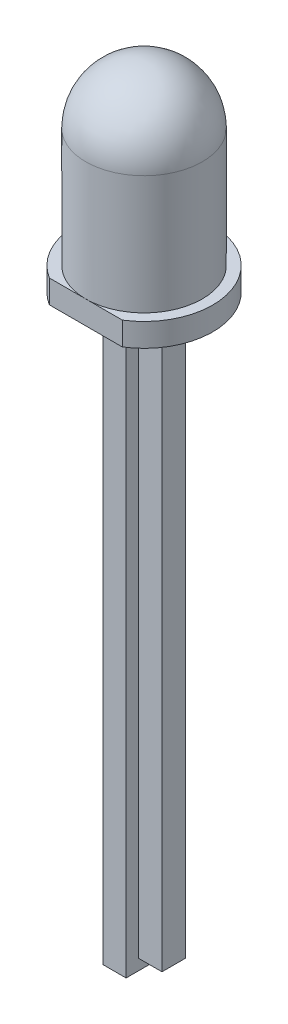
ISO-10303-21;
HEADER;
FILE_DESCRIPTION(('STEP AP214'),'2;1');
FILE_NAME('part.step','',(''),(''),'','','');
FILE_SCHEMA(('AUTOMOTIVE_DESIGN { 1 0 10303 214 1 1 1 1 }'));
ENDSEC;
DATA;
#1=APPLICATION_CONTEXT('core data for automotive mechanical design processes');
#2=APPLICATION_PROTOCOL_DEFINITION('international standard','automotive_design',2000,#1);
#3=PRODUCT_CONTEXT('',#1,'mechanical');
#4=PRODUCT('Part','Part','',(#3));
#5=PRODUCT_RELATED_PRODUCT_CATEGORY('part','',(#4));
#6=PRODUCT_DEFINITION_FORMATION('','',#4);
#7=PRODUCT_DEFINITION_CONTEXT('part definition',#1,'design');
#8=PRODUCT_DEFINITION('design','',#6,#7);
#9=PRODUCT_DEFINITION_SHAPE('','',#8);
#10=(LENGTH_UNIT() NAMED_UNIT(*) SI_UNIT(.MILLI.,.METRE.));
#11=(NAMED_UNIT(*) PLANE_ANGLE_UNIT() SI_UNIT($,.RADIAN.));
#12=(NAMED_UNIT(*) SI_UNIT($,.STERADIAN.) SOLID_ANGLE_UNIT());
#13=UNCERTAINTY_MEASURE_WITH_UNIT(LENGTH_MEASURE(1.E-05),#10,'distance_accuracy_value','');
#14=(GEOMETRIC_REPRESENTATION_CONTEXT(3) GLOBAL_UNCERTAINTY_ASSIGNED_CONTEXT((#13)) GLOBAL_UNIT_ASSIGNED_CONTEXT((#10,
#11,#12)) REPRESENTATION_CONTEXT('',''));
#15=CARTESIAN_POINT('',(0.,0.,0.));
#16=DIRECTION('',(0.,0.,1.));
#17=DIRECTION('',(1.,0.,0.));
#18=AXIS2_PLACEMENT_3D('',#15,#16,#17);
#19=CARTESIAN_POINT('',(-0.499999999999584,0.381000000000242,0.5));
#20=DIRECTION('',(0.,0.,-1.));
#21=DIRECTION('',(-1.,0.,0.));
#22=AXIS2_PLACEMENT_3D('',#19,#20,#21);
#23=PLANE('',#22);
#24=CARTESIAN_POINT('',(0.75400000000006,-0.254000000000434,0.5));
#25=DIRECTION('',(0.,0.,-1.));
#26=DIRECTION('',(-1.,0.,0.));
#27=AXIS2_PLACEMENT_3D('',#24,#25,#26);
#28=CIRCLE('',#27,0.254);
#29=CARTESIAN_POINT('',(0.50000000000007,-0.254000000000185,0.5));
#30=VERTEX_POINT('',#29);
#31=CARTESIAN_POINT('',(0.754000000000005,-4.44089209850063E-13,0.5));
#32=VERTEX_POINT('',#31);
#33=EDGE_CURVE('E179',#30,#32,#28,.T.);
#34=ORIENTED_EDGE('',*,*,#33,.T.);
#35=DIRECTION('',(0.,-1.,0.));
#36=VECTOR('',#35,1.);
#37=CARTESIAN_POINT('',(0.754000000000421,0.380999999999562,0.5));
#38=LINE('',#37,#36);
#39=CARTESIAN_POINT('',(0.754000000000421,0.380999999999562,0.5));
#40=VERTEX_POINT('',#39);
#41=EDGE_CURVE('E167',#40,#32,#38,.T.);
#42=ORIENTED_EDGE('',*,*,#41,.F.);
#43=DIRECTION('',(1.,0.,0.));
#44=VECTOR('',#43,1.);
#45=CARTESIAN_POINT('',(-0.499999999999584,0.381000000000242,0.5));
#46=LINE('',#45,#44);
#47=CARTESIAN_POINT('',(-0.24599999999958,0.381000000000242,0.5));
#48=VERTEX_POINT('',#47);
#49=EDGE_CURVE('E231',#48,#40,#46,.T.);
#50=ORIENTED_EDGE('',*,*,#49,.F.);
#51=CARTESIAN_POINT('',(-0.245999999999566,0.127000000000252,0.5));
#52=DIRECTION('',(0.,0.,-1.));
#53=DIRECTION('',(-1.,0.,0.));
#54=AXIS2_PLACEMENT_3D('',#51,#52,#53);
#55=CIRCLE('',#54,0.254);
#56=CARTESIAN_POINT('',(-0.49999999999957,0.127000000000252,0.5));
#57=VERTEX_POINT('',#56);
#58=EDGE_CURVE('E261',#48,#57,#55,.F.);
#59=ORIENTED_EDGE('',*,*,#58,.T.);
#60=DIRECTION('',(0.,-1.,0.));
#61=VECTOR('',#60,1.);
#62=CARTESIAN_POINT('',(-0.499999999999584,0.381000000000242,0.5));
#63=LINE('',#62,#61);
#64=CARTESIAN_POINT('',(-0.499999999999584,-24.9999999999995,0.5));
#65=VERTEX_POINT('',#64);
#66=EDGE_CURVE('E243',#57,#65,#63,.T.);
#67=ORIENTED_EDGE('',*,*,#66,.T.);
#68=DIRECTION('',(-1.,0.,0.));
#69=VECTOR('',#68,1.);
#70=CARTESIAN_POINT('',(0.500000000000417,-24.9999999999998,0.5));
#71=LINE('',#70,#69);
#72=CARTESIAN_POINT('',(0.500000000000417,-24.9999999999998,0.5));
#73=VERTEX_POINT('',#72);
#74=EDGE_CURVE('E291',#73,#65,#71,.T.);
#75=ORIENTED_EDGE('',*,*,#74,.F.);
#76=DIRECTION('',(0.,1.,0.));
#77=VECTOR('',#76,1.);
#78=CARTESIAN_POINT('',(0.5,-23.9999999999998,0.5));
#79=LINE('',#78,#77);
#80=EDGE_CURVE('E181',#73,#30,#79,.T.);
#81=ORIENTED_EDGE('',*,*,#80,.T.);
#82=EDGE_LOOP('',(#34,#42,#50,#59,#67,#75,#81));
#83=FACE_BOUND('',#82,.T.);
#84=ADVANCED_FACE('F51',(#83),#23,.F.);
#85=CARTESIAN_POINT('',(-0.499999999999584,0.381000000000242,-0.5));
#86=DIRECTION('',(0.,0.,1.));
#87=DIRECTION('',(1.,0.,0.));
#88=AXIS2_PLACEMENT_3D('',#85,#86,#87);
#89=PLANE('',#88);
#90=DIRECTION('',(-1.,0.,0.));
#91=VECTOR('',#90,1.);
#92=CARTESIAN_POINT('',(-0.499999999999584,0.381000000000242,-0.5));
#93=LINE('',#92,#91);
#94=CARTESIAN_POINT('',(0.754000000000421,0.380999999999562,-0.5));
#95=VERTEX_POINT('',#94);
#96=CARTESIAN_POINT('',(-0.24599999999958,0.381000000000242,-0.5));
#97=VERTEX_POINT('',#96);
#98=EDGE_CURVE('E233',#95,#97,#93,.T.);
#99=ORIENTED_EDGE('',*,*,#98,.F.);
#100=DIRECTION('',(0.,-1.,0.));
#101=VECTOR('',#100,1.);
#102=CARTESIAN_POINT('',(0.754000000000421,0.380999999999562,-0.5));
#103=LINE('',#102,#101);
#104=CARTESIAN_POINT('',(0.754000000000005,-4.44089209850063E-13,-0.5));
#105=VERTEX_POINT('',#104);
#106=EDGE_CURVE('E318',#95,#105,#103,.T.);
#107=ORIENTED_EDGE('',*,*,#106,.T.);
#108=CARTESIAN_POINT('',(0.75400000000006,-0.254000000000434,-0.5));
#109=DIRECTION('',(0.,0.,1.));
#110=DIRECTION('',(1.,0.,0.));
#111=AXIS2_PLACEMENT_3D('',#108,#109,#110);
#112=CIRCLE('',#111,0.254);
#113=CARTESIAN_POINT('',(0.50000000000007,-0.254000000000185,-0.5));
#114=VERTEX_POINT('',#113);
#115=EDGE_CURVE('E74',#105,#114,#112,.T.);
#116=ORIENTED_EDGE('',*,*,#115,.T.);
#117=DIRECTION('',(0.,1.,0.));
#118=VECTOR('',#117,1.);
#119=CARTESIAN_POINT('',(0.5,-23.9999999999998,-0.5));
#120=LINE('',#119,#118);
#121=CARTESIAN_POINT('',(0.500000000000417,-24.9999999999998,-0.5));
#122=VERTEX_POINT('',#121);
#123=EDGE_CURVE('E247',#122,#114,#120,.T.);
#124=ORIENTED_EDGE('',*,*,#123,.F.);
#125=DIRECTION('',(1.,0.,0.));
#126=VECTOR('',#125,1.);
#127=CARTESIAN_POINT('',(-0.499999999999584,-24.9999999999995,-0.5));
#128=LINE('',#127,#126);
#129=CARTESIAN_POINT('',(-0.499999999999584,-24.9999999999995,-0.5));
#130=VERTEX_POINT('',#129);
#131=EDGE_CURVE('E281',#130,#122,#128,.T.);
#132=ORIENTED_EDGE('',*,*,#131,.F.);
#133=DIRECTION('',(0.,-1.,0.));
#134=VECTOR('',#133,1.);
#135=CARTESIAN_POINT('',(-0.499999999999584,0.381000000000242,-0.5));
#136=LINE('',#135,#134);
#137=CARTESIAN_POINT('',(-0.49999999999957,0.127000000000252,-0.5));
#138=VERTEX_POINT('',#137);
#139=EDGE_CURVE('E237',#138,#130,#136,.T.);
#140=ORIENTED_EDGE('',*,*,#139,.F.);
#141=CARTESIAN_POINT('',(-0.245999999999566,0.127000000000252,-0.5));
#142=DIRECTION('',(0.,0.,1.));
#143=DIRECTION('',(1.,0.,0.));
#144=AXIS2_PLACEMENT_3D('',#141,#142,#143);
#145=CIRCLE('',#144,0.254);
#146=EDGE_CURVE('E267',#138,#97,#145,.F.);
#147=ORIENTED_EDGE('',*,*,#146,.T.);
#148=EDGE_LOOP('',(#99,#107,#116,#124,#132,#140,#147));
#149=FACE_BOUND('',#148,.T.);
#150=ADVANCED_FACE('F279',(#149),#89,.F.);
#151=CARTESIAN_POINT('',(-0.499999999999584,0.381000000000242,-0.5));
#152=DIRECTION('',(1.,0.,0.));
#153=DIRECTION('',(0.,0.,-1.));
#154=AXIS2_PLACEMENT_3D('',#151,#152,#153);
#155=PLANE('',#154);
#156=ORIENTED_EDGE('',*,*,#66,.F.);
#157=DIRECTION('',(0.,0.,1.));
#158=VECTOR('',#157,1.);
#159=CARTESIAN_POINT('',(-0.49999999999957,0.127000000000252,-0.5));
#160=LINE('',#159,#158);
#161=EDGE_CURVE('E263',#57,#138,#160,.F.);
#162=ORIENTED_EDGE('',*,*,#161,.T.);
#163=ORIENTED_EDGE('',*,*,#139,.T.);
#164=DIRECTION('',(0.,0.,-1.));
#165=VECTOR('',#164,1.);
#166=CARTESIAN_POINT('',(-0.499999999999584,-24.9999999999995,0.5));
#167=LINE('',#166,#165);
#168=EDGE_CURVE('E287',#65,#130,#167,.T.);
#169=ORIENTED_EDGE('',*,*,#168,.F.);
#170=EDGE_LOOP('',(#156,#162,#163,#169));
#171=FACE_BOUND('',#170,.T.);
#172=ADVANCED_FACE('F341',(#171),#155,.F.);
#173=CARTESIAN_POINT('',(0.786000000000411,0.380999999999562,0.5));
#174=VERTEX_POINT('',#173);
#175=CARTESIAN_POINT('',(1.78600000000041,0.380999999999812,0.5));
#176=VERTEX_POINT('',#175);
#177=EDGE_CURVE('E234',#174,#176,#46,.T.);
#178=ORIENTED_EDGE('',*,*,#177,.F.);
#179=DIRECTION('',(0.,1.,0.));
#180=VECTOR('',#179,1.);
#181=CARTESIAN_POINT('',(0.786000000000411,0.380999999999562,0.5));
#182=LINE('',#181,#180);
#183=CARTESIAN_POINT('',(0.786000000000009,-4.44089209850063E-13,0.5));
#184=VERTEX_POINT('',#183);
#185=EDGE_CURVE('E66',#184,#174,#182,.T.);
#186=ORIENTED_EDGE('',*,*,#185,.F.);
#187=CARTESIAN_POINT('',(0.786000000000064,-0.254000000000434,0.5));
#188=DIRECTION('',(0.,0.,-1.));
#189=DIRECTION('',(-1.,0.,0.));
#190=AXIS2_PLACEMENT_3D('',#187,#188,#189);
#191=CIRCLE('',#190,0.254);
#192=CARTESIAN_POINT('',(1.04000000000007,-0.253999999999754,0.5));
#193=VERTEX_POINT('',#192);
#194=EDGE_CURVE('E59',#184,#193,#191,.T.);
#195=ORIENTED_EDGE('',*,*,#194,.T.);
#196=DIRECTION('',(0.,1.,0.));
#197=VECTOR('',#196,1.);
#198=CARTESIAN_POINT('',(1.04,-23.9999999999999,0.5));
#199=LINE('',#198,#197);
#200=CARTESIAN_POINT('',(1.04,-23.9999999999999,0.5));
#201=VERTEX_POINT('',#200);
#202=EDGE_CURVE('E206',#201,#193,#199,.T.);
#203=ORIENTED_EDGE('',*,*,#202,.F.);
#204=DIRECTION('',(-1.,0.,0.));
#205=VECTOR('',#204,1.);
#206=CARTESIAN_POINT('',(2.04,-23.9999999999998,0.5));
#207=LINE('',#206,#205);
#208=CARTESIAN_POINT('',(2.04,-23.9999999999998,0.5));
#209=VERTEX_POINT('',#208);
#210=EDGE_CURVE('E297',#209,#201,#207,.T.);
#211=ORIENTED_EDGE('',*,*,#210,.F.);
#212=DIRECTION('',(0.,-1.,0.));
#213=VECTOR('',#212,1.);
#214=CARTESIAN_POINT('',(2.04000000000042,0.380999999999812,0.5));
#215=LINE('',#214,#213);
#216=CARTESIAN_POINT('',(2.04000000000047,0.126999999999808,0.5));
#217=VERTEX_POINT('',#216);
#218=EDGE_CURVE('E241',#217,#209,#215,.T.);
#219=ORIENTED_EDGE('',*,*,#218,.F.);
#220=CARTESIAN_POINT('',(1.78600000000043,0.126999999999808,0.5));
#221=DIRECTION('',(0.,0.,-1.));
#222=DIRECTION('',(-1.,0.,0.));
#223=AXIS2_PLACEMENT_3D('',#220,#221,#222);
#224=CIRCLE('',#223,0.254);
#225=EDGE_CURVE('E258',#217,#176,#224,.F.);
#226=ORIENTED_EDGE('',*,*,#225,.T.);
#227=EDGE_LOOP('',(#178,#186,#195,#203,#211,#219,#226));
#228=FACE_BOUND('',#227,.T.);
#229=ADVANCED_FACE('F204',(#228),#23,.F.);
#230=CARTESIAN_POINT('',(2.04000000000042,0.380999999999812,-0.5));
#231=DIRECTION('',(-1.,0.,0.));
#232=DIRECTION('',(0.,0.,1.));
#233=AXIS2_PLACEMENT_3D('',#230,#231,#232);
#234=PLANE('',#233);
#235=DIRECTION('',(0.,-1.,0.));
#236=VECTOR('',#235,1.);
#237=CARTESIAN_POINT('',(2.04000000000042,0.380999999999812,-0.5));
#238=LINE('',#237,#236);
#239=CARTESIAN_POINT('',(2.04000000000047,0.126999999999808,-0.5));
#240=VERTEX_POINT('',#239);
#241=CARTESIAN_POINT('',(2.04,-23.9999999999998,-0.5));
#242=VERTEX_POINT('',#241);
#243=EDGE_CURVE('E239',#240,#242,#238,.T.);
#244=ORIENTED_EDGE('',*,*,#243,.F.);
#245=DIRECTION('',(0.,0.,-1.));
#246=VECTOR('',#245,1.);
#247=CARTESIAN_POINT('',(2.04000000000047,0.126999999999808,0.5));
#248=LINE('',#247,#246);
#249=EDGE_CURVE('E270',#240,#217,#248,.F.);
#250=ORIENTED_EDGE('',*,*,#249,.T.);
#251=ORIENTED_EDGE('',*,*,#218,.T.);
#252=DIRECTION('',(0.,0.,1.));
#253=VECTOR('',#252,1.);
#254=CARTESIAN_POINT('',(2.04,-23.9999999999998,0.5));
#255=LINE('',#254,#253);
#256=EDGE_CURVE('E289',#242,#209,#255,.T.);
#257=ORIENTED_EDGE('',*,*,#256,.F.);
#258=EDGE_LOOP('',(#244,#250,#251,#257));
#259=FACE_BOUND('',#258,.T.);
#260=ADVANCED_FACE('F368',(#259),#234,.F.);
#261=CARTESIAN_POINT('',(0.786000000000064,-0.254000000000434,-0.5));
#262=DIRECTION('',(0.,0.,1.));
#263=DIRECTION('',(1.,0.,0.));
#264=AXIS2_PLACEMENT_3D('',#261,#262,#263);
#265=CIRCLE('',#264,0.254);
#266=CARTESIAN_POINT('',(1.04000000000007,-0.253999999999754,-0.5));
#267=VERTEX_POINT('',#266);
#268=CARTESIAN_POINT('',(0.786000000000009,-4.44089209850063E-13,-0.5));
#269=VERTEX_POINT('',#268);
#270=EDGE_CURVE('E197',#267,#269,#265,.T.);
#271=ORIENTED_EDGE('',*,*,#270,.T.);
#272=DIRECTION('',(0.,1.,0.));
#273=VECTOR('',#272,1.);
#274=CARTESIAN_POINT('',(0.786000000000411,0.380999999999562,-0.5));
#275=LINE('',#274,#273);
#276=CARTESIAN_POINT('',(0.786000000000411,0.380999999999562,-0.5));
#277=VERTEX_POINT('',#276);
#278=EDGE_CURVE('E222',#269,#277,#275,.T.);
#279=ORIENTED_EDGE('',*,*,#278,.T.);
#280=CARTESIAN_POINT('',(1.78600000000041,0.380999999999812,-0.5));
#281=VERTEX_POINT('',#280);
#282=EDGE_CURVE('E235',#281,#277,#93,.T.);
#283=ORIENTED_EDGE('',*,*,#282,.F.);
#284=CARTESIAN_POINT('',(1.78600000000043,0.126999999999808,-0.5));
#285=DIRECTION('',(0.,0.,1.));
#286=DIRECTION('',(1.,0.,0.));
#287=AXIS2_PLACEMENT_3D('',#284,#285,#286);
#288=CIRCLE('',#287,0.254);
#289=EDGE_CURVE('E265',#281,#240,#288,.F.);
#290=ORIENTED_EDGE('',*,*,#289,.T.);
#291=ORIENTED_EDGE('',*,*,#243,.T.);
#292=DIRECTION('',(1.,0.,0.));
#293=VECTOR('',#292,1.);
#294=CARTESIAN_POINT('',(2.04,-23.9999999999998,-0.5));
#295=LINE('',#294,#293);
#296=CARTESIAN_POINT('',(1.04,-23.9999999999999,-0.5));
#297=VERTEX_POINT('',#296);
#298=EDGE_CURVE('E226',#297,#242,#295,.T.);
#299=ORIENTED_EDGE('',*,*,#298,.F.);
#300=DIRECTION('',(0.,1.,0.));
#301=VECTOR('',#300,1.);
#302=CARTESIAN_POINT('',(1.04,-23.9999999999999,-0.5));
#303=LINE('',#302,#301);
#304=EDGE_CURVE('E216',#297,#267,#303,.T.);
#305=ORIENTED_EDGE('',*,*,#304,.T.);
#306=EDGE_LOOP('',(#271,#279,#283,#290,#291,#299,#305));
#307=FACE_BOUND('',#306,.T.);
#308=ADVANCED_FACE('F221',(#307),#89,.F.);
#309=CARTESIAN_POINT('',(0.5,-23.9999999999998,0.5));
#310=DIRECTION('',(-1.,0.,0.));
#311=DIRECTION('',(0.,0.,1.));
#312=AXIS2_PLACEMENT_3D('',#309,#310,#311);
#313=PLANE('',#312);
#314=ORIENTED_EDGE('',*,*,#123,.T.);
#315=DIRECTION('',(0.,0.,1.));
#316=VECTOR('',#315,1.);
#317=CARTESIAN_POINT('',(0.50000000000007,-0.254000000000185,0.5));
#318=LINE('',#317,#316);
#319=EDGE_CURVE('E192',#114,#30,#318,.T.);
#320=ORIENTED_EDGE('',*,*,#319,.T.);
#321=ORIENTED_EDGE('',*,*,#80,.F.);
#322=DIRECTION('',(0.,0.,1.));
#323=VECTOR('',#322,1.);
#324=CARTESIAN_POINT('',(0.500000000000417,-24.9999999999998,-0.5));
#325=LINE('',#324,#323);
#326=EDGE_CURVE('E275',#122,#73,#325,.T.);
#327=ORIENTED_EDGE('',*,*,#326,.F.);
#328=EDGE_LOOP('',(#314,#320,#321,#327));
#329=FACE_BOUND('',#328,.T.);
#330=ADVANCED_FACE('F272',(#329),#313,.F.);
#331=CARTESIAN_POINT('',(1.04,-23.9999999999999,0.5));
#332=DIRECTION('',(1.,0.,0.));
#333=DIRECTION('',(0.,0.,-1.));
#334=AXIS2_PLACEMENT_3D('',#331,#332,#333);
#335=PLANE('',#334);
#336=ORIENTED_EDGE('',*,*,#202,.T.);
#337=DIRECTION('',(0.,0.,-1.));
#338=VECTOR('',#337,1.);
#339=CARTESIAN_POINT('',(1.04000000000007,-0.253999999999754,-0.5));
#340=LINE('',#339,#338);
#341=EDGE_CURVE('E185',#193,#267,#340,.T.);
#342=ORIENTED_EDGE('',*,*,#341,.T.);
#343=ORIENTED_EDGE('',*,*,#304,.F.);
#344=DIRECTION('',(0.,0.,-1.));
#345=VECTOR('',#344,1.);
#346=CARTESIAN_POINT('',(1.04,-23.9999999999999,0.5));
#347=LINE('',#346,#345);
#348=EDGE_CURVE('E215',#201,#297,#347,.T.);
#349=ORIENTED_EDGE('',*,*,#348,.F.);
#350=EDGE_LOOP('',(#336,#342,#343,#349));
#351=FACE_BOUND('',#350,.T.);
#352=ADVANCED_FACE('F212',(#351),#335,.F.);
#353=CARTESIAN_POINT('',(2.04,-23.9999999999998,-0.5));
#354=DIRECTION('',(0.,1.,0.));
#355=DIRECTION('',(0.,0.,1.));
#356=AXIS2_PLACEMENT_3D('',#353,#354,#355);
#357=PLANE('',#356);
#358=ORIENTED_EDGE('',*,*,#256,.T.);
#359=ORIENTED_EDGE('',*,*,#210,.T.);
#360=ORIENTED_EDGE('',*,*,#348,.T.);
#361=ORIENTED_EDGE('',*,*,#298,.T.);
#362=EDGE_LOOP('',(#358,#359,#360,#361));
#363=FACE_BOUND('',#362,.T.);
#364=ADVANCED_FACE('F299',(#363),#357,.F.);
#365=CARTESIAN_POINT('',(4.16333634234434E-13,-24.9999999999999,0.));
#366=DIRECTION('',(0.,-1.,0.));
#367=DIRECTION('',(0.,0.,-1.));
#368=AXIS2_PLACEMENT_3D('',#365,#366,#367);
#369=PLANE('',#368);
#370=ORIENTED_EDGE('',*,*,#74,.T.);
#371=ORIENTED_EDGE('',*,*,#168,.T.);
#372=ORIENTED_EDGE('',*,*,#131,.T.);
#373=ORIENTED_EDGE('',*,*,#326,.T.);
#374=EDGE_LOOP('',(#370,#371,#372,#373));
#375=FACE_BOUND('',#374,.T.);
#376=ADVANCED_FACE('F285',(#375),#369,.T.);
#377=CARTESIAN_POINT('',(-0.245999999999566,0.127000000000252,0.5));
#378=DIRECTION('',(0.,0.,-1.));
#379=DIRECTION('',(-1.,0.,0.));
#380=AXIS2_PLACEMENT_3D('',#377,#378,#379);
#381=CYLINDRICAL_SURFACE('',#380,0.254);
#382=ORIENTED_EDGE('',*,*,#146,.F.);
#383=ORIENTED_EDGE('',*,*,#161,.F.);
#384=ORIENTED_EDGE('',*,*,#58,.F.);
#385=DIRECTION('',(0.,0.,1.));
#386=VECTOR('',#385,1.);
#387=CARTESIAN_POINT('',(-0.24599999999958,0.381000000000242,0.5));
#388=LINE('',#387,#386);
#389=EDGE_CURVE('E255',#97,#48,#388,.T.);
#390=ORIENTED_EDGE('',*,*,#389,.F.);
#391=EDGE_LOOP('',(#382,#383,#384,#390));
#392=FACE_BOUND('',#391,.T.);
#393=ADVANCED_FACE('F345',(#392),#381,.T.);
#394=CARTESIAN_POINT('',(1.78600000000043,0.126999999999808,0.5));
#395=DIRECTION('',(0.,0.,1.));
#396=DIRECTION('',(1.,0.,0.));
#397=AXIS2_PLACEMENT_3D('',#394,#395,#396);
#398=CYLINDRICAL_SURFACE('',#397,0.254);
#399=ORIENTED_EDGE('',*,*,#225,.F.);
#400=ORIENTED_EDGE('',*,*,#249,.F.);
#401=ORIENTED_EDGE('',*,*,#289,.F.);
#402=DIRECTION('',(0.,0.,-1.));
#403=VECTOR('',#402,1.);
#404=CARTESIAN_POINT('',(1.78600000000041,0.380999999999812,-0.5));
#405=LINE('',#404,#403);
#406=EDGE_CURVE('E245',#176,#281,#405,.T.);
#407=ORIENTED_EDGE('',*,*,#406,.F.);
#408=EDGE_LOOP('',(#399,#400,#401,#407));
#409=FACE_BOUND('',#408,.T.);
#410=ADVANCED_FACE('F307',(#409),#398,.T.);
#411=CARTESIAN_POINT('',(0.75400000000006,-0.254000000000434,0.5));
#412=DIRECTION('',(0.,0.,-1.));
#413=DIRECTION('',(-1.,0.,0.));
#414=AXIS2_PLACEMENT_3D('',#411,#412,#413);
#415=CYLINDRICAL_SURFACE('',#414,0.254);
#416=ORIENTED_EDGE('',*,*,#115,.F.);
#417=DIRECTION('',(0.,0.,1.));
#418=VECTOR('',#417,1.);
#419=CARTESIAN_POINT('',(0.754000000000005,-4.44089209850063E-13,-0.5));
#420=LINE('',#419,#418);
#421=EDGE_CURVE('E171',#32,#105,#420,.F.);
#422=ORIENTED_EDGE('',*,*,#421,.F.);
#423=ORIENTED_EDGE('',*,*,#33,.F.);
#424=ORIENTED_EDGE('',*,*,#319,.F.);
#425=EDGE_LOOP('',(#416,#422,#423,#424));
#426=FACE_BOUND('',#425,.T.);
#427=ADVANCED_FACE('F187',(#426),#415,.F.);
#428=CARTESIAN_POINT('',(0.786000000000064,-0.254000000000434,0.5));
#429=DIRECTION('',(0.,0.,1.));
#430=DIRECTION('',(1.,0.,0.));
#431=AXIS2_PLACEMENT_3D('',#428,#429,#430);
#432=CYLINDRICAL_SURFACE('',#431,0.254);
#433=ORIENTED_EDGE('',*,*,#194,.F.);
#434=DIRECTION('',(0.,0.,-1.));
#435=VECTOR('',#434,1.);
#436=CARTESIAN_POINT('',(0.786000000000009,-4.44089209850063E-13,0.5));
#437=LINE('',#436,#435);
#438=EDGE_CURVE('E188',#269,#184,#437,.F.);
#439=ORIENTED_EDGE('',*,*,#438,.F.);
#440=ORIENTED_EDGE('',*,*,#270,.F.);
#441=ORIENTED_EDGE('',*,*,#341,.F.);
#442=EDGE_LOOP('',(#433,#439,#440,#441));
#443=FACE_BOUND('',#442,.T.);
#444=ADVANCED_FACE('F218',(#443),#432,.F.);
#445=CARTESIAN_POINT('',(0.770000000000409,0.380999999999562,0.));
#446=DIRECTION('',(0.,1.,0.));
#447=DIRECTION('',(0.,0.,1.));
#448=AXIS2_PLACEMENT_3D('',#445,#446,#447);
#449=PLANE('',#448);
#450=DIRECTION('',(0.,0.,1.));
#451=VECTOR('',#450,1.);
#452=CARTESIAN_POINT('',(0.754000000000421,0.380999999999562,-2.95000000000001));
#453=LINE('',#452,#451);
#454=EDGE_CURVE('E173',#95,#40,#453,.T.);
#455=ORIENTED_EDGE('',*,*,#454,.F.);
#456=ORIENTED_EDGE('',*,*,#98,.T.);
#457=ORIENTED_EDGE('',*,*,#389,.T.);
#458=ORIENTED_EDGE('',*,*,#49,.T.);
#459=EDGE_LOOP('',(#455,#456,#457,#458));
#460=FACE_BOUND('',#459,.T.);
#461=ORIENTED_EDGE('',*,*,#282,.T.);
#462=DIRECTION('',(0.,0.,1.));
#463=VECTOR('',#462,1.);
#464=CARTESIAN_POINT('',(0.786000000000411,0.380999999999562,-2.95000000000001));
#465=LINE('',#464,#463);
#466=EDGE_CURVE('E312',#277,#174,#465,.T.);
#467=ORIENTED_EDGE('',*,*,#466,.T.);
#468=ORIENTED_EDGE('',*,*,#177,.T.);
#469=ORIENTED_EDGE('',*,*,#406,.T.);
#470=EDGE_LOOP('',(#461,#467,#468,#469));
#471=FACE_BOUND('',#470,.T.);
#472=DIRECTION('',(1.,0.,0.));
#473=VECTOR('',#472,1.);
#474=CARTESIAN_POINT('',(2.33604597633698,0.380999999999812,2.5));
#475=LINE('',#474,#473);
#476=CARTESIAN_POINT('',(-0.796045976336188,0.381000000000464,2.5));
#477=VERTEX_POINT('',#476);
#478=CARTESIAN_POINT('',(2.33604597633698,0.380999999999812,2.5));
#479=VERTEX_POINT('',#478);
#480=EDGE_CURVE('E328',#477,#479,#475,.T.);
#481=ORIENTED_EDGE('',*,*,#480,.F.);
#482=CARTESIAN_POINT('',(0.770000000000409,0.380999999999562,0.));
#483=DIRECTION('',(0.,1.,0.));
#484=DIRECTION('',(0.,0.,1.));
#485=AXIS2_PLACEMENT_3D('',#482,#483,#484);
#486=CIRCLE('',#485,2.95);
#487=EDGE_CURVE('E323',#479,#477,#486,.T.);
#488=ORIENTED_EDGE('',*,*,#487,.F.);
#489=EDGE_LOOP('',(#481,#488));
#490=FACE_BOUND('',#489,.T.);
#491=ADVANCED_FACE('F310',(#460,#471,#490),#449,.F.);
#492=CARTESIAN_POINT('',(0.770000000000062,1.38100000000077,0.));
#493=DIRECTION('',(0.,-1.,0.));
#494=DIRECTION('',(0.,0.,-1.));
#495=AXIS2_PLACEMENT_3D('',#492,#493,#494);
#496=CYLINDRICAL_SURFACE('',#495,2.95);
#497=ORIENTED_EDGE('',*,*,#487,.T.);
#498=DIRECTION('',(0.,-1.,0.));
#499=VECTOR('',#498,1.);
#500=CARTESIAN_POINT('',(-0.796045976336521,1.38100000000024,2.5));
#501=LINE('',#500,#499);
#502=CARTESIAN_POINT('',(-0.796045976336521,1.38100000000024,2.5));
#503=VERTEX_POINT('',#502);
#504=EDGE_CURVE('E336',#503,#477,#501,.T.);
#505=ORIENTED_EDGE('',*,*,#504,.F.);
#506=CARTESIAN_POINT('',(0.770000000000062,1.38100000000077,0.));
#507=DIRECTION('',(0.,1.,0.));
#508=DIRECTION('',(0.,0.,1.));
#509=AXIS2_PLACEMENT_3D('',#506,#507,#508);
#510=CIRCLE('',#509,2.95);
#511=CARTESIAN_POINT('',(2.33604597633665,1.38100000000033,2.5));
#512=VERTEX_POINT('',#511);
#513=EDGE_CURVE('E324',#512,#503,#510,.T.);
#514=ORIENTED_EDGE('',*,*,#513,.F.);
#515=DIRECTION('',(0.,-1.,0.));
#516=VECTOR('',#515,1.);
#517=CARTESIAN_POINT('',(2.33604597633665,1.38100000000033,2.5));
#518=LINE('',#517,#516);
#519=EDGE_CURVE('E331',#512,#479,#518,.T.);
#520=ORIENTED_EDGE('',*,*,#519,.T.);
#521=EDGE_LOOP('',(#497,#505,#514,#520));
#522=FACE_BOUND('',#521,.T.);
#523=ADVANCED_FACE('F348',(#522),#496,.T.);
#524=CARTESIAN_POINT('',(2.33604597633665,1.38100000000033,2.5));
#525=DIRECTION('',(0.,0.,-1.));
#526=DIRECTION('',(-1.,0.,0.));
#527=AXIS2_PLACEMENT_3D('',#524,#525,#526);
#528=PLANE('',#527);
#529=ORIENTED_EDGE('',*,*,#480,.T.);
#530=ORIENTED_EDGE('',*,*,#519,.F.);
#531=DIRECTION('',(1.,0.,0.));
#532=VECTOR('',#531,1.);
#533=CARTESIAN_POINT('',(2.33604597633665,1.38100000000033,2.5));
#534=LINE('',#533,#532);
#535=CARTESIAN_POINT('',(0.770000000000062,1.38100000000077,2.5));
#536=VERTEX_POINT('',#535);
#537=EDGE_CURVE('E327',#536,#512,#534,.T.);
#538=ORIENTED_EDGE('',*,*,#537,.F.);
#539=EDGE_CURVE('E329',#503,#536,#534,.T.);
#540=ORIENTED_EDGE('',*,*,#539,.F.);
#541=ORIENTED_EDGE('',*,*,#504,.T.);
#542=EDGE_LOOP('',(#529,#530,#538,#540,#541));
#543=FACE_BOUND('',#542,.T.);
#544=ADVANCED_FACE('F354',(#543),#528,.F.);
#545=CARTESIAN_POINT('',(0.770000000000062,1.38100000000077,0.));
#546=DIRECTION('',(0.,1.,0.));
#547=DIRECTION('',(0.,0.,1.));
#548=AXIS2_PLACEMENT_3D('',#545,#546,#547);
#549=PLANE('',#548);
#550=ORIENTED_EDGE('',*,*,#539,.T.);
#551=CARTESIAN_POINT('',(0.770000000000062,1.38100000000077,0.));
#552=DIRECTION('',(0.,1.,0.));
#553=DIRECTION('',(0.,0.,1.));
#554=AXIS2_PLACEMENT_3D('',#551,#552,#553);
#555=CIRCLE('',#554,2.5);
#556=EDGE_CURVE('E320',#536,#536,#555,.T.);
#557=ORIENTED_EDGE('',*,*,#556,.F.);
#558=ORIENTED_EDGE('',*,*,#537,.T.);
#559=ORIENTED_EDGE('',*,*,#513,.T.);
#560=EDGE_LOOP('',(#550,#557,#558,#559));
#561=FACE_BOUND('',#560,.T.);
#562=ADVANCED_FACE('F410',(#561),#549,.T.);
#563=CARTESIAN_POINT('',(0.770000000000409,8.98100000000102,0.));
#564=DIRECTION('',(0.,-1.,0.));
#565=DIRECTION('',(0.,0.,-1.));
#566=AXIS2_PLACEMENT_3D('',#563,#564,#565);
#567=CYLINDRICAL_SURFACE('',#566,2.5);
#568=CARTESIAN_POINT('',(0.770000000000062,6.48100000000079,0.));
#569=DIRECTION('',(0.,-1.,0.));
#570=DIRECTION('',(0.,0.,-1.));
#571=AXIS2_PLACEMENT_3D('',#568,#569,#570);
#572=CIRCLE('',#571,2.5);
#573=CARTESIAN_POINT('',(0.770000000000062,6.48100000000079,-2.5));
#574=VERTEX_POINT('',#573);
#575=EDGE_CURVE('E14',#574,#574,#572,.T.);
#576=ORIENTED_EDGE('',*,*,#575,.T.);
#577=EDGE_LOOP('',(#576));
#578=FACE_BOUND('',#577,.T.);
#579=ORIENTED_EDGE('',*,*,#556,.T.);
#580=EDGE_LOOP('',(#579));
#581=FACE_BOUND('',#580,.T.);
#582=ADVANCED_FACE('F418',(#578,#581),#567,.T.);
#583=CARTESIAN_POINT('',(0.770000000000062,6.48100000000079,0.));
#584=DIRECTION('',(0.,0.,1.));
#585=DIRECTION('',(1.,0.,0.));
#586=AXIS2_PLACEMENT_3D('',#583,#584,#585);
#587=SPHERICAL_SURFACE('',#586,2.5);
#588=CARTESIAN_POINT('',(0.770000000000062,6.48100000000079,0.));
#589=DIRECTION('',(0.,-1.,0.));
#590=DIRECTION('',(0.,0.,-1.));
#591=AXIS2_PLACEMENT_3D('',#588,#589,#590);
#592=SPHERICAL_SURFACE('',#591,2.5);
#593=ORIENTED_EDGE('',*,*,#575,.F.);
#594=EDGE_LOOP('',(#593));
#595=FACE_BOUND('',#594,.T.);
#596=ADVANCED_FACE('F53',(#595),#592,.T.);
#597=CARTESIAN_POINT('',(0.754000000000421,0.380999999999562,-2.95000000000001));
#598=DIRECTION('',(-1.,0.,0.));
#599=DIRECTION('',(0.,0.,1.));
#600=AXIS2_PLACEMENT_3D('',#597,#598,#599);
#601=PLANE('',#600);
#602=ORIENTED_EDGE('',*,*,#454,.T.);
#603=ORIENTED_EDGE('',*,*,#41,.T.);
#604=ORIENTED_EDGE('',*,*,#421,.T.);
#605=ORIENTED_EDGE('',*,*,#106,.F.);
#606=EDGE_LOOP('',(#602,#603,#604,#605));
#607=FACE_BOUND('',#606,.T.);
#608=ADVANCED_FACE('F169',(#607),#601,.F.);
#609=CARTESIAN_POINT('',(0.786000000000411,0.380999999999562,-2.95000000000001));
#610=DIRECTION('',(1.,0.,0.));
#611=DIRECTION('',(0.,0.,-1.));
#612=AXIS2_PLACEMENT_3D('',#609,#610,#611);
#613=PLANE('',#612);
#614=ORIENTED_EDGE('',*,*,#438,.T.);
#615=ORIENTED_EDGE('',*,*,#185,.T.);
#616=ORIENTED_EDGE('',*,*,#466,.F.);
#617=ORIENTED_EDGE('',*,*,#278,.F.);
#618=EDGE_LOOP('',(#614,#615,#616,#617));
#619=FACE_BOUND('',#618,.T.);
#620=ADVANCED_FACE('F463',(#619),#613,.F.);
#621=CLOSED_SHELL('',(#84,#150,#172,#229,#260,#308,#330,#352,#364,#376,#393,#410,#427,#444,#491,
#523,#544,#562,#582,#596,#608,#620));
#622=MANIFOLD_SOLID_BREP('B2',#621);
#623=ADVANCED_BREP_SHAPE_REPRESENTATION('',(#18,#622),#14);
#624=SHAPE_DEFINITION_REPRESENTATION(#9,#623);
ENDSEC;
END-ISO-10303-21;
